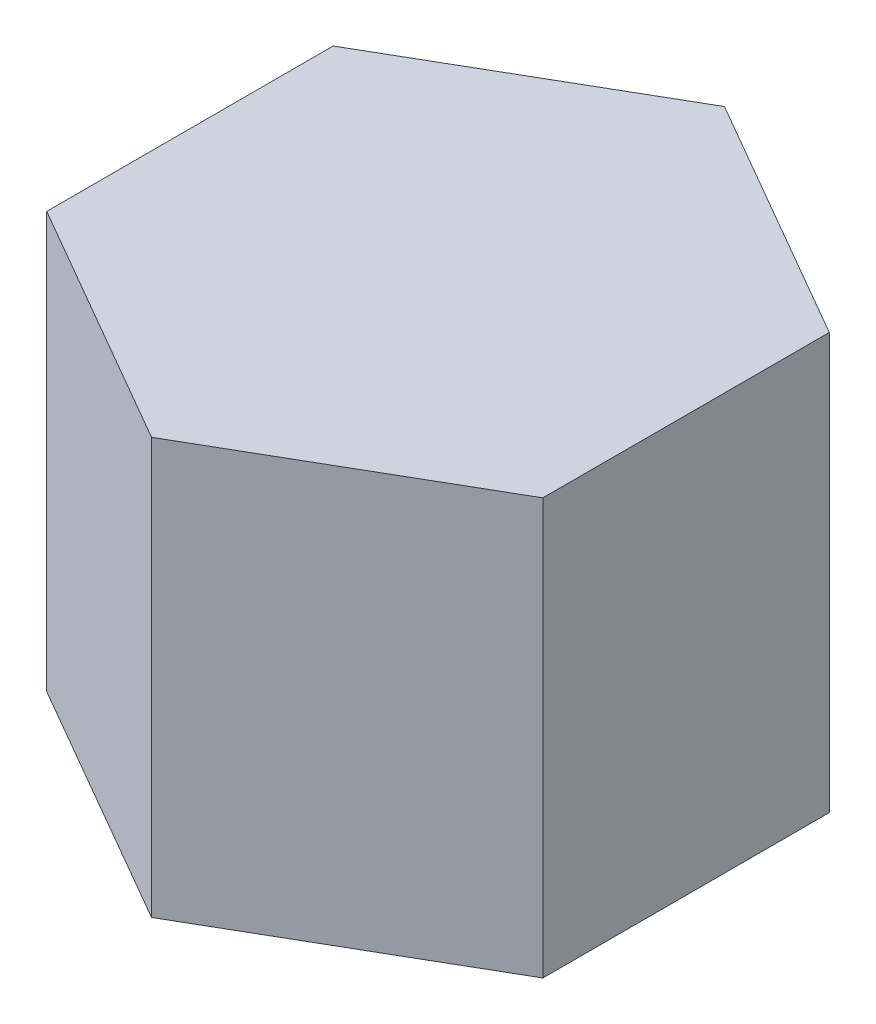
ISO-10303-21;
HEADER;
FILE_DESCRIPTION(('STEP AP214'),'2;1');
FILE_NAME('part.step','',(''),(''),'','','');
FILE_SCHEMA(('AUTOMOTIVE_DESIGN { 1 0 10303 214 1 1 1 1 }'));
ENDSEC;
DATA;
#1=APPLICATION_CONTEXT('core data for automotive mechanical design processes');
#2=APPLICATION_PROTOCOL_DEFINITION('international standard','automotive_design',2000,#1);
#3=PRODUCT_CONTEXT('',#1,'mechanical');
#4=PRODUCT('Part','Part','',(#3));
#5=PRODUCT_RELATED_PRODUCT_CATEGORY('part','',(#4));
#6=PRODUCT_DEFINITION_FORMATION('','',#4);
#7=PRODUCT_DEFINITION_CONTEXT('part definition',#1,'design');
#8=PRODUCT_DEFINITION('design','',#6,#7);
#9=PRODUCT_DEFINITION_SHAPE('','',#8);
#10=(LENGTH_UNIT() NAMED_UNIT(*) SI_UNIT(.MILLI.,.METRE.));
#11=(NAMED_UNIT(*) PLANE_ANGLE_UNIT() SI_UNIT($,.RADIAN.));
#12=(NAMED_UNIT(*) SI_UNIT($,.STERADIAN.) SOLID_ANGLE_UNIT());
#13=UNCERTAINTY_MEASURE_WITH_UNIT(LENGTH_MEASURE(1.E-05),#10,'distance_accuracy_value','');
#14=(GEOMETRIC_REPRESENTATION_CONTEXT(3) GLOBAL_UNCERTAINTY_ASSIGNED_CONTEXT((#13)) GLOBAL_UNIT_ASSIGNED_CONTEXT((#10,
#11,#12)) REPRESENTATION_CONTEXT('',''));
#15=CARTESIAN_POINT('',(0.,0.,0.));
#16=DIRECTION('',(0.,0.,1.));
#17=DIRECTION('',(1.,0.,0.));
#18=AXIS2_PLACEMENT_3D('',#15,#16,#17);
#19=CARTESIAN_POINT('',(205.142660308706,-148.537700895744,295.837098239417));
#20=DIRECTION('',(-0.499999999999943,0.,-0.866025403784472));
#21=DIRECTION('',(-0.866025403784472,0.,0.499999999999943));
#22=AXIS2_PLACEMENT_3D('',#19,#20,#21);
#23=PLANE('',#22);
#24=CARTESIAN_POINT('',(204.839551417381,-149.045793579175,296.012098239417));
#25=DIRECTION('',(0.866025403784471,0.,-0.499999999999943));
#26=VECTOR('',#25,1.);
#27=LINE('',#24,#26);
#28=CARTESIAN_POINT('',(204.839551417382,-149.045793579175,296.012098239417));
#29=VERTEX_POINT('',#28);
#30=CARTESIAN_POINT('',(205.142660308706,-149.045793579175,295.837098239417));
#31=VERTEX_POINT('',#30);
#32=EDGE_CURVE('E170',#29,#31,#27,.T.);
#33=ORIENTED_EDGE('',*,*,#32,.T.);
#34=CARTESIAN_POINT('',(205.142660308706,-148.537700895744,295.837098239417));
#35=DIRECTION('',(0.,-1.,0.));
#36=VECTOR('',#35,1.);
#37=LINE('',#34,#36);
#38=CARTESIAN_POINT('',(205.142660308706,-148.537700895744,295.837098239417));
#39=VERTEX_POINT('',#38);
#40=EDGE_CURVE('E35',#39,#31,#37,.T.);
#41=ORIENTED_EDGE('',*,*,#40,.F.);
#42=CARTESIAN_POINT('',(204.839551417381,-148.537700895744,296.012098239417));
#43=DIRECTION('',(0.866025403784471,0.,-0.499999999999943));
#44=VECTOR('',#43,1.);
#45=LINE('',#42,#44);
#46=CARTESIAN_POINT('',(204.839551417382,-148.537700895744,296.012098239417));
#47=VERTEX_POINT('',#46);
#48=EDGE_CURVE('E159',#47,#39,#45,.T.);
#49=ORIENTED_EDGE('',*,*,#48,.F.);
#50=CARTESIAN_POINT('',(204.839551417381,-148.537700895744,296.012098239417));
#51=DIRECTION('',(0.,-1.,0.));
#52=VECTOR('',#51,1.);
#53=LINE('',#50,#52);
#54=EDGE_CURVE('E10',#47,#29,#53,.T.);
#55=ORIENTED_EDGE('',*,*,#54,.T.);
#56=EDGE_LOOP('',(#33,#41,#49,#55));
#57=FACE_BOUND('',#56,.T.);
#58=ADVANCED_FACE('F16',(#57),#23,.F.);
#59=CARTESIAN_POINT('',(204.839551417382,-148.537700895744,296.012098239417));
#60=DIRECTION('',(0.500000000000062,0.,-0.866025403784403));
#61=DIRECTION('',(-0.866025403784403,0.,-0.500000000000062));
#62=AXIS2_PLACEMENT_3D('',#59,#60,#61);
#63=PLANE('',#62);
#64=CARTESIAN_POINT('',(204.536442526057,-149.045793579175,295.837098239417));
#65=DIRECTION('',(0.866025403784403,0.,0.500000000000062));
#66=VECTOR('',#65,1.);
#67=LINE('',#64,#66);
#68=CARTESIAN_POINT('',(204.536442526057,-149.045793579175,295.837098239417));
#69=VERTEX_POINT('',#68);
#70=EDGE_CURVE('E167',#69,#29,#67,.T.);
#71=ORIENTED_EDGE('',*,*,#70,.T.);
#72=ORIENTED_EDGE('',*,*,#54,.F.);
#73=CARTESIAN_POINT('',(204.536442526057,-148.537700895744,295.837098239417));
#74=DIRECTION('',(0.866025403784403,0.,0.500000000000062));
#75=VECTOR('',#74,1.);
#76=LINE('',#73,#75);
#77=CARTESIAN_POINT('',(204.536442526057,-148.537700895744,295.837098239417));
#78=VERTEX_POINT('',#77);
#79=EDGE_CURVE('E156',#78,#47,#76,.T.);
#80=ORIENTED_EDGE('',*,*,#79,.F.);
#81=CARTESIAN_POINT('',(204.536442526057,-148.537700895744,295.837098239417));
#82=DIRECTION('',(0.,-1.,0.));
#83=VECTOR('',#82,1.);
#84=LINE('',#81,#83);
#85=EDGE_CURVE('E27',#78,#69,#84,.T.);
#86=ORIENTED_EDGE('',*,*,#85,.T.);
#87=EDGE_LOOP('',(#71,#72,#80,#86));
#88=FACE_BOUND('',#87,.T.);
#89=ADVANCED_FACE('F189',(#88),#63,.F.);
#90=CARTESIAN_POINT('',(204.536442526057,-148.537700895744,290.831971220494));
#91=DIRECTION('',(1.,0.,0.));
#92=DIRECTION('',(0.,1.,0.));
#93=AXIS2_PLACEMENT_3D('',#90,#91,#92);
#94=PLANE('',#93);
#95=CARTESIAN_POINT('',(204.536442526057,-149.045793579175,295.487098239417));
#96=DIRECTION('',(0.,0.,1.));
#97=VECTOR('',#96,1.);
#98=LINE('',#95,#97);
#99=CARTESIAN_POINT('',(204.536442526057,-149.045793579175,295.487098239417));
#100=VERTEX_POINT('',#99);
#101=EDGE_CURVE('E163',#100,#69,#98,.T.);
#102=ORIENTED_EDGE('',*,*,#101,.T.);
#103=ORIENTED_EDGE('',*,*,#85,.F.);
#104=CARTESIAN_POINT('',(204.536442526057,-148.537700895744,295.487098239417));
#105=DIRECTION('',(0.,0.,1.));
#106=VECTOR('',#105,1.);
#107=LINE('',#104,#106);
#108=CARTESIAN_POINT('',(204.536442526057,-148.537700895744,295.487098239417));
#109=VERTEX_POINT('',#108);
#110=EDGE_CURVE('E106',#109,#78,#107,.T.);
#111=ORIENTED_EDGE('',*,*,#110,.F.);
#112=CARTESIAN_POINT('',(204.536442526057,-148.537700895744,295.487098239417));
#113=DIRECTION('',(0.,-1.,0.));
#114=VECTOR('',#113,1.);
#115=LINE('',#112,#114);
#116=EDGE_CURVE('E94',#109,#100,#115,.T.);
#117=ORIENTED_EDGE('',*,*,#116,.T.);
#118=EDGE_LOOP('',(#102,#103,#111,#117));
#119=FACE_BOUND('',#118,.T.);
#120=ADVANCED_FACE('F198',(#119),#94,.F.);
#121=CARTESIAN_POINT('',(204.536442526057,-148.537700895744,295.487098239417));
#122=DIRECTION('',(0.499999999999978,0.,0.866025403784452));
#123=DIRECTION('',(0.866025403784452,0.,-0.499999999999978));
#124=AXIS2_PLACEMENT_3D('',#121,#122,#123);
#125=PLANE('',#124);
#126=CARTESIAN_POINT('',(204.839551417382,-149.045793579175,295.312098239417));
#127=DIRECTION('',(-0.866025403784452,0.,0.499999999999978));
#128=VECTOR('',#127,1.);
#129=LINE('',#126,#128);
#130=CARTESIAN_POINT('',(204.839551417382,-149.045793579175,295.312098239417));
#131=VERTEX_POINT('',#130);
#132=EDGE_CURVE('E162',#131,#100,#129,.T.);
#133=ORIENTED_EDGE('',*,*,#132,.T.);
#134=ORIENTED_EDGE('',*,*,#116,.F.);
#135=CARTESIAN_POINT('',(204.839551417382,-148.537700895744,295.312098239417));
#136=DIRECTION('',(-0.866025403784452,0.,0.499999999999978));
#137=VECTOR('',#136,1.);
#138=LINE('',#135,#137);
#139=CARTESIAN_POINT('',(204.839551417382,-148.537700895744,295.312098239417));
#140=VERTEX_POINT('',#139);
#141=EDGE_CURVE('E98',#140,#109,#138,.T.);
#142=ORIENTED_EDGE('',*,*,#141,.F.);
#143=CARTESIAN_POINT('',(204.839551417382,-148.537700895744,295.312098239417));
#144=DIRECTION('',(0.,-1.,0.));
#145=VECTOR('',#144,1.);
#146=LINE('',#143,#145);
#147=EDGE_CURVE('E79',#140,#131,#146,.T.);
#148=ORIENTED_EDGE('',*,*,#147,.T.);
#149=EDGE_LOOP('',(#133,#134,#142,#148));
#150=FACE_BOUND('',#149,.T.);
#151=ADVANCED_FACE('F100',(#150),#125,.F.);
#152=CARTESIAN_POINT('',(204.839551417382,-148.537700895744,295.312098239417));
#153=DIRECTION('',(-0.500000000000096,0.,0.866025403784383));
#154=DIRECTION('',(0.866025403784383,0.,0.500000000000096));
#155=AXIS2_PLACEMENT_3D('',#152,#153,#154);
#156=PLANE('',#155);
#157=CARTESIAN_POINT('',(205.142660308706,-149.045793579175,295.487098239417));
#158=DIRECTION('',(-0.866025403784383,0.,-0.500000000000096));
#159=VECTOR('',#158,1.);
#160=LINE('',#157,#159);
#161=CARTESIAN_POINT('',(205.142660308706,-149.045793579175,295.487098239417));
#162=VERTEX_POINT('',#161);
#163=EDGE_CURVE('E88',#162,#131,#160,.T.);
#164=ORIENTED_EDGE('',*,*,#163,.T.);
#165=ORIENTED_EDGE('',*,*,#147,.F.);
#166=CARTESIAN_POINT('',(205.142660308706,-148.537700895744,295.487098239417));
#167=DIRECTION('',(-0.866025403784383,0.,-0.500000000000096));
#168=VECTOR('',#167,1.);
#169=LINE('',#166,#168);
#170=CARTESIAN_POINT('',(205.142660308706,-148.537700895744,295.487098239417));
#171=VERTEX_POINT('',#170);
#172=EDGE_CURVE('E84',#171,#140,#169,.T.);
#173=ORIENTED_EDGE('',*,*,#172,.F.);
#174=CARTESIAN_POINT('',(205.142660308706,-148.537700895744,295.487098239417));
#175=DIRECTION('',(0.,-1.,0.));
#176=VECTOR('',#175,1.);
#177=LINE('',#174,#176);
#178=EDGE_CURVE('E58',#171,#162,#177,.T.);
#179=ORIENTED_EDGE('',*,*,#178,.T.);
#180=EDGE_LOOP('',(#164,#165,#173,#179));
#181=FACE_BOUND('',#180,.T.);
#182=ADVANCED_FACE('F82',(#181),#156,.F.);
#183=CARTESIAN_POINT('',(205.142660308706,-148.537700895744,290.831971220494));
#184=DIRECTION('',(-1.,0.,0.));
#185=DIRECTION('',(0.,-1.,0.));
#186=AXIS2_PLACEMENT_3D('',#183,#184,#185);
#187=PLANE('',#186);
#188=CARTESIAN_POINT('',(205.142660308706,-149.045793579175,295.837098239417));
#189=DIRECTION('',(0.,0.,-1.));
#190=VECTOR('',#189,1.);
#191=LINE('',#188,#190);
#192=EDGE_CURVE('E160',#31,#162,#191,.T.);
#193=ORIENTED_EDGE('',*,*,#192,.T.);
#194=ORIENTED_EDGE('',*,*,#178,.F.);
#195=CARTESIAN_POINT('',(205.142660308706,-148.537700895744,295.837098239417));
#196=DIRECTION('',(0.,0.,-1.));
#197=VECTOR('',#196,1.);
#198=LINE('',#195,#197);
#199=EDGE_CURVE('E112',#39,#171,#198,.T.);
#200=ORIENTED_EDGE('',*,*,#199,.F.);
#201=ORIENTED_EDGE('',*,*,#40,.T.);
#202=EDGE_LOOP('',(#193,#194,#200,#201));
#203=FACE_BOUND('',#202,.T.);
#204=ADVANCED_FACE('F131',(#203),#187,.F.);
#205=CARTESIAN_POINT('',(206.339551417382,-148.537700895744,290.831971220494));
#206=DIRECTION('',(0.,-1.,0.));
#207=DIRECTION('',(1.,0.,0.));
#208=AXIS2_PLACEMENT_3D('',#205,#206,#207);
#209=PLANE('',#208);
#210=ORIENTED_EDGE('',*,*,#48,.T.);
#211=ORIENTED_EDGE('',*,*,#199,.T.);
#212=ORIENTED_EDGE('',*,*,#172,.T.);
#213=ORIENTED_EDGE('',*,*,#141,.T.);
#214=ORIENTED_EDGE('',*,*,#110,.T.);
#215=ORIENTED_EDGE('',*,*,#79,.T.);
#216=EDGE_LOOP('',(#210,#211,#212,#213,#214,#215));
#217=FACE_BOUND('',#216,.T.);
#218=ADVANCED_FACE('F111',(#217),#209,.F.);
#219=CARTESIAN_POINT('',(206.339551417382,-149.045793579175,290.831971220494));
#220=DIRECTION('',(0.,-1.,0.));
#221=DIRECTION('',(1.,0.,0.));
#222=AXIS2_PLACEMENT_3D('',#219,#220,#221);
#223=PLANE('',#222);
#224=ORIENTED_EDGE('',*,*,#32,.F.);
#225=ORIENTED_EDGE('',*,*,#70,.F.);
#226=ORIENTED_EDGE('',*,*,#101,.F.);
#227=ORIENTED_EDGE('',*,*,#132,.F.);
#228=ORIENTED_EDGE('',*,*,#163,.F.);
#229=ORIENTED_EDGE('',*,*,#192,.F.);
#230=EDGE_LOOP('',(#224,#225,#226,#227,#228,#229));
#231=FACE_BOUND('',#230,.T.);
#232=ADVANCED_FACE('F130',(#231),#223,.T.);
#233=CLOSED_SHELL('',(#58,#89,#120,#151,#182,#204,#218,#232));
#234=MANIFOLD_SOLID_BREP('B1',#233);
#235=ADVANCED_BREP_SHAPE_REPRESENTATION('',(#18,#234),#14);
#236=SHAPE_DEFINITION_REPRESENTATION(#9,#235);
ENDSEC;
END-ISO-10303-21;
